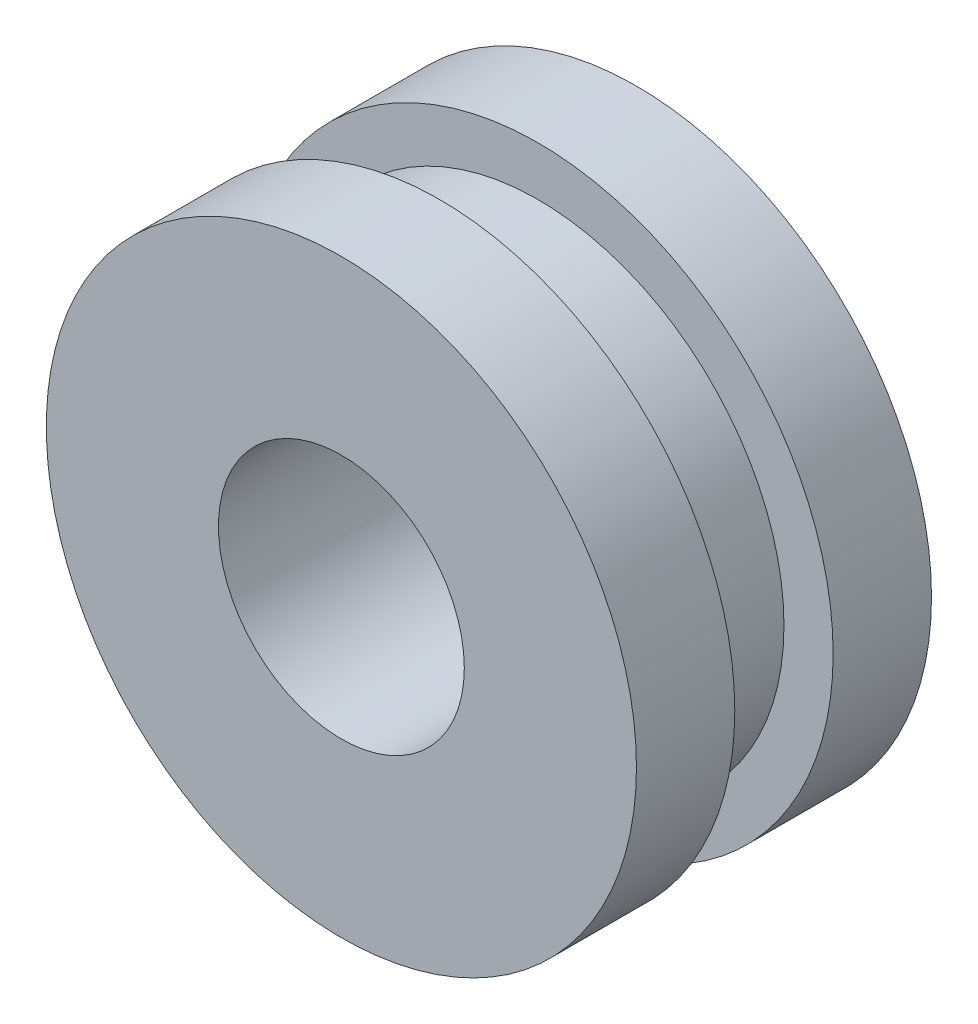
ISO-10303-21;
HEADER;
FILE_DESCRIPTION(('STEP AP214'),'2;1');
FILE_NAME('part.step','',(''),(''),'','','');
FILE_SCHEMA(('AUTOMOTIVE_DESIGN { 1 0 10303 214 1 1 1 1 }'));
ENDSEC;
DATA;
#1=APPLICATION_CONTEXT('core data for automotive mechanical design processes');
#2=APPLICATION_PROTOCOL_DEFINITION('international standard','automotive_design',2000,#1);
#3=PRODUCT_CONTEXT('',#1,'mechanical');
#4=PRODUCT('Part','Part','',(#3));
#5=PRODUCT_RELATED_PRODUCT_CATEGORY('part','',(#4));
#6=PRODUCT_DEFINITION_FORMATION('','',#4);
#7=PRODUCT_DEFINITION_CONTEXT('part definition',#1,'design');
#8=PRODUCT_DEFINITION('design','',#6,#7);
#9=PRODUCT_DEFINITION_SHAPE('','',#8);
#10=(LENGTH_UNIT() NAMED_UNIT(*) SI_UNIT(.MILLI.,.METRE.));
#11=(NAMED_UNIT(*) PLANE_ANGLE_UNIT() SI_UNIT($,.RADIAN.));
#12=(NAMED_UNIT(*) SI_UNIT($,.STERADIAN.) SOLID_ANGLE_UNIT());
#13=UNCERTAINTY_MEASURE_WITH_UNIT(LENGTH_MEASURE(1.E-05),#10,'distance_accuracy_value','');
#14=(GEOMETRIC_REPRESENTATION_CONTEXT(3) GLOBAL_UNCERTAINTY_ASSIGNED_CONTEXT((#13)) GLOBAL_UNIT_ASSIGNED_CONTEXT((#10,
#11,#12)) REPRESENTATION_CONTEXT('',''));
#15=CARTESIAN_POINT('',(0.,0.,0.));
#16=DIRECTION('',(0.,0.,1.));
#17=DIRECTION('',(1.,0.,0.));
#18=AXIS2_PLACEMENT_3D('',#15,#16,#17);
#19=CARTESIAN_POINT('',(0.,0.,2.54));
#20=DIRECTION('',(0.,0.,-1.));
#21=DIRECTION('',(-1.,0.,0.));
#22=AXIS2_PLACEMENT_3D('',#19,#20,#21);
#23=CYLINDRICAL_SURFACE('',#22,7.62);
#24=CARTESIAN_POINT('',(0.,0.,2.54));
#25=DIRECTION('',(0.,0.,1.));
#26=DIRECTION('',(1.,0.,0.));
#27=AXIS2_PLACEMENT_3D('',#24,#25,#26);
#28=CIRCLE('',#27,7.62);
#29=CARTESIAN_POINT('',(7.62,0.,2.54));
#30=VERTEX_POINT('',#29);
#31=EDGE_CURVE('E40',#30,#30,#28,.T.);
#32=ORIENTED_EDGE('',*,*,#31,.F.);
#33=EDGE_LOOP('',(#32));
#34=FACE_BOUND('',#33,.T.);
#35=CARTESIAN_POINT('',(0.,0.,0.));
#36=DIRECTION('',(0.,0.,1.));
#37=DIRECTION('',(1.,0.,0.));
#38=AXIS2_PLACEMENT_3D('',#35,#36,#37);
#39=CIRCLE('',#38,7.62);
#40=CARTESIAN_POINT('',(7.62,0.,0.));
#41=VERTEX_POINT('',#40);
#42=EDGE_CURVE('E36',#41,#41,#39,.T.);
#43=ORIENTED_EDGE('',*,*,#42,.T.);
#44=EDGE_LOOP('',(#43));
#45=FACE_BOUND('',#44,.T.);
#46=ADVANCED_FACE('F33',(#34,#45),#23,.T.);
#47=CARTESIAN_POINT('',(0.,0.,2.54));
#48=DIRECTION('',(0.,0.,1.));
#49=DIRECTION('',(1.,0.,0.));
#50=AXIS2_PLACEMENT_3D('',#47,#48,#49);
#51=PLANE('',#50);
#52=CARTESIAN_POINT('',(0.,0.,2.54));
#53=DIRECTION('',(0.,0.,1.));
#54=DIRECTION('',(1.,0.,0.));
#55=AXIS2_PLACEMENT_3D('',#52,#53,#54);
#56=CIRCLE('',#55,6.35);
#57=CARTESIAN_POINT('',(6.35,0.,2.54));
#58=VERTEX_POINT('',#57);
#59=EDGE_CURVE('E10',#58,#58,#56,.T.);
#60=ORIENTED_EDGE('',*,*,#59,.F.);
#61=EDGE_LOOP('',(#60));
#62=FACE_BOUND('',#61,.T.);
#63=ORIENTED_EDGE('',*,*,#31,.T.);
#64=EDGE_LOOP('',(#63));
#65=FACE_BOUND('',#64,.T.);
#66=ADVANCED_FACE('F92',(#62,#65),#51,.T.);
#67=CARTESIAN_POINT('',(0.,0.,0.));
#68=DIRECTION('',(0.,0.,1.));
#69=DIRECTION('',(1.,0.,0.));
#70=AXIS2_PLACEMENT_3D('',#67,#68,#69);
#71=PLANE('',#70);
#72=CARTESIAN_POINT('',(0.,0.,0.));
#73=DIRECTION('',(0.,0.,1.));
#74=DIRECTION('',(1.,0.,0.));
#75=AXIS2_PLACEMENT_3D('',#72,#73,#74);
#76=CIRCLE('',#75,3.175);
#77=CARTESIAN_POINT('',(3.175,0.,0.));
#78=VERTEX_POINT('',#77);
#79=EDGE_CURVE('E53',#78,#78,#76,.T.);
#80=ORIENTED_EDGE('',*,*,#79,.T.);
#81=EDGE_LOOP('',(#80));
#82=FACE_BOUND('',#81,.T.);
#83=ORIENTED_EDGE('',*,*,#42,.F.);
#84=EDGE_LOOP('',(#83));
#85=FACE_BOUND('',#84,.T.);
#86=ADVANCED_FACE('F62',(#82,#85),#71,.F.);
#87=CARTESIAN_POINT('',(0.,0.,5.08));
#88=DIRECTION('',(0.,0.,-1.));
#89=DIRECTION('',(-1.,0.,0.));
#90=AXIS2_PLACEMENT_3D('',#87,#88,#89);
#91=CYLINDRICAL_SURFACE('',#90,6.35);
#92=CARTESIAN_POINT('',(0.,0.,5.08));
#93=DIRECTION('',(0.,0.,1.));
#94=DIRECTION('',(1.,0.,0.));
#95=AXIS2_PLACEMENT_3D('',#92,#93,#94);
#96=CIRCLE('',#95,6.35);
#97=CARTESIAN_POINT('',(6.35,0.,5.08));
#98=VERTEX_POINT('',#97);
#99=EDGE_CURVE('E46',#98,#98,#96,.T.);
#100=ORIENTED_EDGE('',*,*,#99,.F.);
#101=EDGE_LOOP('',(#100));
#102=FACE_BOUND('',#101,.T.);
#103=ORIENTED_EDGE('',*,*,#59,.T.);
#104=EDGE_LOOP('',(#103));
#105=FACE_BOUND('',#104,.T.);
#106=ADVANCED_FACE('F80',(#102,#105),#91,.T.);
#107=CARTESIAN_POINT('',(0.,0.,5.08));
#108=DIRECTION('',(0.,0.,1.));
#109=DIRECTION('',(1.,0.,0.));
#110=AXIS2_PLACEMENT_3D('',#107,#108,#109);
#111=CYLINDRICAL_SURFACE('',#110,7.62);
#112=CARTESIAN_POINT('',(0.,0.,5.08));
#113=DIRECTION('',(0.,0.,1.));
#114=DIRECTION('',(1.,0.,0.));
#115=AXIS2_PLACEMENT_3D('',#112,#113,#114);
#116=CIRCLE('',#115,7.62);
#117=CARTESIAN_POINT('',(7.62,0.,5.08));
#118=VERTEX_POINT('',#117);
#119=EDGE_CURVE('E49',#118,#118,#116,.T.);
#120=ORIENTED_EDGE('',*,*,#119,.T.);
#121=EDGE_LOOP('',(#120));
#122=FACE_BOUND('',#121,.T.);
#123=CARTESIAN_POINT('',(0.,0.,7.62));
#124=DIRECTION('',(0.,0.,1.));
#125=DIRECTION('',(1.,0.,0.));
#126=AXIS2_PLACEMENT_3D('',#123,#124,#125);
#127=CIRCLE('',#126,7.62);
#128=CARTESIAN_POINT('',(7.62,0.,7.62));
#129=VERTEX_POINT('',#128);
#130=EDGE_CURVE('E50',#129,#129,#127,.T.);
#131=ORIENTED_EDGE('',*,*,#130,.F.);
#132=EDGE_LOOP('',(#131));
#133=FACE_BOUND('',#132,.T.);
#134=ADVANCED_FACE('F78',(#122,#133),#111,.T.);
#135=CARTESIAN_POINT('',(0.,0.,5.08));
#136=DIRECTION('',(0.,0.,-1.));
#137=DIRECTION('',(1.,0.,0.));
#138=AXIS2_PLACEMENT_3D('',#135,#136,#137);
#139=PLANE('',#138);
#140=ORIENTED_EDGE('',*,*,#99,.T.);
#141=EDGE_LOOP('',(#140));
#142=FACE_BOUND('',#141,.T.);
#143=ORIENTED_EDGE('',*,*,#119,.F.);
#144=EDGE_LOOP('',(#143));
#145=FACE_BOUND('',#144,.T.);
#146=ADVANCED_FACE('F74',(#142,#145),#139,.T.);
#147=CARTESIAN_POINT('',(0.,0.,7.62));
#148=DIRECTION('',(0.,0.,-1.));
#149=DIRECTION('',(1.,0.,0.));
#150=AXIS2_PLACEMENT_3D('',#147,#148,#149);
#151=PLANE('',#150);
#152=CARTESIAN_POINT('',(0.,0.,7.62));
#153=DIRECTION('',(0.,0.,1.));
#154=DIRECTION('',(1.,0.,0.));
#155=AXIS2_PLACEMENT_3D('',#152,#153,#154);
#156=CIRCLE('',#155,3.175);
#157=CARTESIAN_POINT('',(3.175,0.,7.62));
#158=VERTEX_POINT('',#157);
#159=EDGE_CURVE('E56',#158,#158,#156,.T.);
#160=ORIENTED_EDGE('',*,*,#159,.F.);
#161=EDGE_LOOP('',(#160));
#162=FACE_BOUND('',#161,.T.);
#163=ORIENTED_EDGE('',*,*,#130,.T.);
#164=EDGE_LOOP('',(#163));
#165=FACE_BOUND('',#164,.T.);
#166=ADVANCED_FACE('F68',(#162,#165),#151,.F.);
#167=CARTESIAN_POINT('',(0.,0.,0.));
#168=DIRECTION('',(0.,0.,1.));
#169=DIRECTION('',(1.,0.,0.));
#170=AXIS2_PLACEMENT_3D('',#167,#168,#169);
#171=CYLINDRICAL_SURFACE('',#170,3.175);
#172=ORIENTED_EDGE('',*,*,#79,.F.);
#173=EDGE_LOOP('',(#172));
#174=FACE_BOUND('',#173,.T.);
#175=ORIENTED_EDGE('',*,*,#159,.T.);
#176=EDGE_LOOP('',(#175));
#177=FACE_BOUND('',#176,.T.);
#178=ADVANCED_FACE('F65',(#174,#177),#171,.F.);
#179=CLOSED_SHELL('',(#46,#66,#86,#106,#134,#146,#166,#178));
#180=MANIFOLD_SOLID_BREP('B2',#179);
#181=ADVANCED_BREP_SHAPE_REPRESENTATION('',(#18,#180),#14);
#182=SHAPE_DEFINITION_REPRESENTATION(#9,#181);
ENDSEC;
END-ISO-10303-21;
